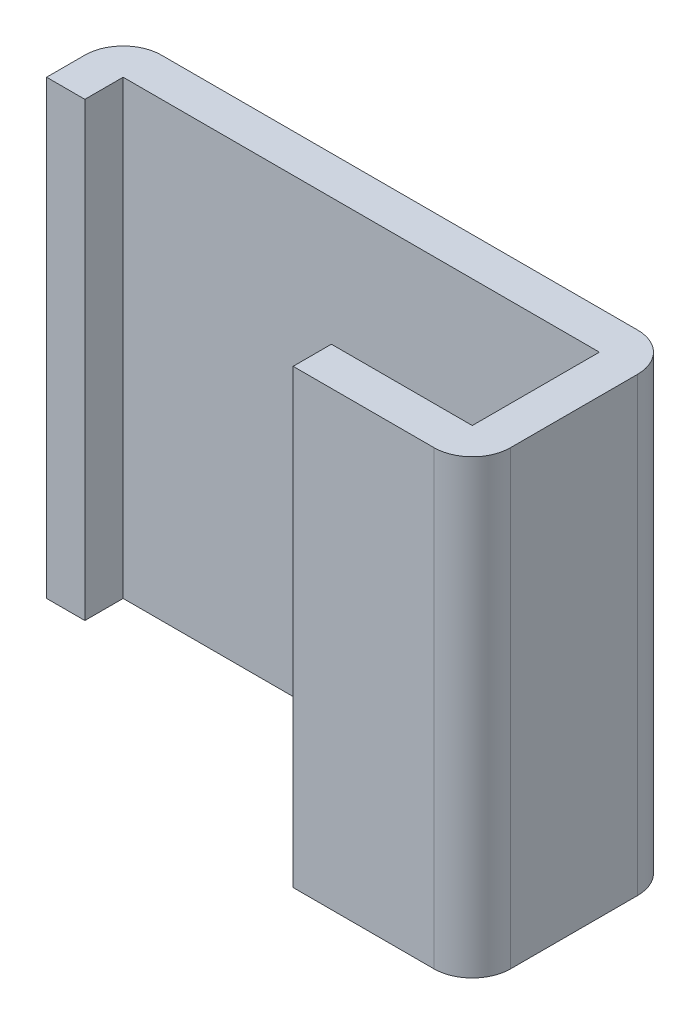
ISO-10303-21;
HEADER;
FILE_DESCRIPTION(('STEP AP214'),'2;1');
FILE_NAME('part.step','',(''),(''),'','','');
FILE_SCHEMA(('AUTOMOTIVE_DESIGN { 1 0 10303 214 1 1 1 1 }'));
ENDSEC;
DATA;
#1=APPLICATION_CONTEXT('core data for automotive mechanical design processes');
#2=APPLICATION_PROTOCOL_DEFINITION('international standard','automotive_design',2000,#1);
#3=PRODUCT_CONTEXT('',#1,'mechanical');
#4=PRODUCT('Part','Part','',(#3));
#5=PRODUCT_RELATED_PRODUCT_CATEGORY('part','',(#4));
#6=PRODUCT_DEFINITION_FORMATION('','',#4);
#7=PRODUCT_DEFINITION_CONTEXT('part definition',#1,'design');
#8=PRODUCT_DEFINITION('design','',#6,#7);
#9=PRODUCT_DEFINITION_SHAPE('','',#8);
#10=(LENGTH_UNIT() NAMED_UNIT(*) SI_UNIT(.MILLI.,.METRE.));
#11=(NAMED_UNIT(*) PLANE_ANGLE_UNIT() SI_UNIT($,.RADIAN.));
#12=(NAMED_UNIT(*) SI_UNIT($,.STERADIAN.) SOLID_ANGLE_UNIT());
#13=UNCERTAINTY_MEASURE_WITH_UNIT(LENGTH_MEASURE(1.E-05),#10,'distance_accuracy_value','');
#14=(GEOMETRIC_REPRESENTATION_CONTEXT(3) GLOBAL_UNCERTAINTY_ASSIGNED_CONTEXT((#13)) GLOBAL_UNIT_ASSIGNED_CONTEXT((#10,
#11,#12)) REPRESENTATION_CONTEXT('',''));
#15=CARTESIAN_POINT('',(0.,0.,0.));
#16=DIRECTION('',(0.,0.,1.));
#17=DIRECTION('',(1.,0.,0.));
#18=AXIS2_PLACEMENT_3D('',#15,#16,#17);
#19=CARTESIAN_POINT('',(-15.24,-1.474,1.08));
#20=DIRECTION('',(1.,0.,0.));
#21=DIRECTION('',(0.,0.,-1.));
#22=AXIS2_PLACEMENT_3D('',#19,#20,#21);
#23=PLANE('',#22);
#24=DIRECTION('',(0.,1.,0.));
#25=VECTOR('',#24,1.);
#26=CARTESIAN_POINT('',(-15.24,-1.474,1.33));
#27=LINE('',#26,#25);
#28=CARTESIAN_POINT('',(-15.24,1.474,1.33));
#29=VERTEX_POINT('',#28);
#30=CARTESIAN_POINT('',(-15.24,-1.474,1.33));
#31=VERTEX_POINT('',#30);
#32=EDGE_CURVE('E98',#29,#31,#27,.F.);
#33=ORIENTED_EDGE('',*,*,#32,.F.);
#34=DIRECTION('',(0.,0.,-1.));
#35=VECTOR('',#34,1.);
#36=CARTESIAN_POINT('',(-15.24,1.474,1.08));
#37=LINE('',#36,#35);
#38=CARTESIAN_POINT('',(-15.24,1.474,1.08));
#39=VERTEX_POINT('',#38);
#40=EDGE_CURVE('E103',#39,#29,#37,.F.);
#41=ORIENTED_EDGE('',*,*,#40,.F.);
#42=DIRECTION('',(0.,1.,0.));
#43=VECTOR('',#42,1.);
#44=CARTESIAN_POINT('',(-15.24,-1.474,1.08));
#45=LINE('',#44,#43);
#46=CARTESIAN_POINT('',(-15.24,-1.474,1.08));
#47=VERTEX_POINT('',#46);
#48=EDGE_CURVE('E127',#39,#47,#45,.F.);
#49=ORIENTED_EDGE('',*,*,#48,.T.);
#50=DIRECTION('',(0.,0.,-1.));
#51=VECTOR('',#50,1.);
#52=CARTESIAN_POINT('',(-15.24,-1.474,1.08));
#53=LINE('',#52,#51);
#54=EDGE_CURVE('E84',#31,#47,#53,.T.);
#55=ORIENTED_EDGE('',*,*,#54,.F.);
#56=EDGE_LOOP('',(#33,#41,#49,#55));
#57=FACE_BOUND('',#56,.T.);
#58=ADVANCED_FACE('F17',(#57),#23,.F.);
#59=CARTESIAN_POINT('',(-14.32,-1.474,1.33));
#60=DIRECTION('',(0.,0.,1.));
#61=DIRECTION('',(1.,0.,0.));
#62=AXIS2_PLACEMENT_3D('',#59,#60,#61);
#63=PLANE('',#62);
#64=ORIENTED_EDGE('',*,*,#32,.T.);
#65=DIRECTION('',(1.,0.,0.));
#66=VECTOR('',#65,1.);
#67=CARTESIAN_POINT('',(-14.32,-1.474,1.33));
#68=LINE('',#67,#66);
#69=CARTESIAN_POINT('',(-14.32,-1.474,1.33));
#70=VERTEX_POINT('',#69);
#71=EDGE_CURVE('E78',#31,#70,#68,.T.);
#72=ORIENTED_EDGE('',*,*,#71,.T.);
#73=DIRECTION('',(0.,-1.,0.));
#74=VECTOR('',#73,1.);
#75=CARTESIAN_POINT('',(-14.32,-1.474,1.33));
#76=LINE('',#75,#74);
#77=CARTESIAN_POINT('',(-14.32,1.474,1.33));
#78=VERTEX_POINT('',#77);
#79=EDGE_CURVE('E99',#78,#70,#76,.T.);
#80=ORIENTED_EDGE('',*,*,#79,.F.);
#81=DIRECTION('',(1.,0.,0.));
#82=VECTOR('',#81,1.);
#83=CARTESIAN_POINT('',(-14.32,1.474,1.33));
#84=LINE('',#83,#82);
#85=EDGE_CURVE('E94',#78,#29,#84,.F.);
#86=ORIENTED_EDGE('',*,*,#85,.T.);
#87=EDGE_LOOP('',(#64,#72,#80,#86));
#88=FACE_BOUND('',#87,.T.);
#89=ADVANCED_FACE('F96',(#88),#63,.T.);
#90=CARTESIAN_POINT('',(-14.32,-1.474,1.08));
#91=DIRECTION('',(0.,0.,1.));
#92=DIRECTION('',(1.,0.,0.));
#93=AXIS2_PLACEMENT_3D('',#90,#91,#92);
#94=PLANE('',#93);
#95=ORIENTED_EDGE('',*,*,#48,.F.);
#96=DIRECTION('',(1.,0.,0.));
#97=VECTOR('',#96,1.);
#98=CARTESIAN_POINT('',(-14.32,1.474,1.08));
#99=LINE('',#98,#97);
#100=CARTESIAN_POINT('',(-14.32,1.474,1.08));
#101=VERTEX_POINT('',#100);
#102=EDGE_CURVE('E108',#101,#39,#99,.F.);
#103=ORIENTED_EDGE('',*,*,#102,.F.);
#104=DIRECTION('',(0.,1.,0.));
#105=VECTOR('',#104,1.);
#106=CARTESIAN_POINT('',(-14.32,-1.474,1.08));
#107=LINE('',#106,#105);
#108=CARTESIAN_POINT('',(-14.32,-1.474,1.08));
#109=VERTEX_POINT('',#108);
#110=EDGE_CURVE('E181',#101,#109,#107,.F.);
#111=ORIENTED_EDGE('',*,*,#110,.T.);
#112=DIRECTION('',(1.,0.,0.));
#113=VECTOR('',#112,1.);
#114=CARTESIAN_POINT('',(-14.32,-1.474,1.08));
#115=LINE('',#114,#113);
#116=EDGE_CURVE('E125',#47,#109,#115,.T.);
#117=ORIENTED_EDGE('',*,*,#116,.F.);
#118=EDGE_LOOP('',(#95,#103,#111,#117));
#119=FACE_BOUND('',#118,.T.);
#120=ADVANCED_FACE('F379',(#119),#94,.F.);
#121=CARTESIAN_POINT('',(-14.32,-1.474,1.08));
#122=DIRECTION('',(0.,-1.,0.));
#123=DIRECTION('',(0.,0.,-1.));
#124=AXIS2_PLACEMENT_3D('',#121,#122,#123);
#125=CYLINDRICAL_SURFACE('',#124,0.25);
#126=CARTESIAN_POINT('',(-14.32,1.474,1.08));
#127=DIRECTION('',(0.,-1.,0.));
#128=DIRECTION('',(0.,0.,-1.));
#129=AXIS2_PLACEMENT_3D('',#126,#127,#128);
#130=CIRCLE('',#129,0.25);
#131=CARTESIAN_POINT('',(-14.07,1.474,1.08));
#132=VERTEX_POINT('',#131);
#133=EDGE_CURVE('E147',#132,#78,#130,.T.);
#134=ORIENTED_EDGE('',*,*,#133,.T.);
#135=ORIENTED_EDGE('',*,*,#79,.T.);
#136=CARTESIAN_POINT('',(-14.32,-1.474,1.08));
#137=DIRECTION('',(0.,-1.,0.));
#138=DIRECTION('',(0.,0.,-1.));
#139=AXIS2_PLACEMENT_3D('',#136,#137,#138);
#140=CIRCLE('',#139,0.25);
#141=CARTESIAN_POINT('',(-14.07,-1.474,1.08));
#142=VERTEX_POINT('',#141);
#143=EDGE_CURVE('E20',#70,#142,#140,.F.);
#144=ORIENTED_EDGE('',*,*,#143,.T.);
#145=DIRECTION('',(0.,1.,0.));
#146=VECTOR('',#145,1.);
#147=CARTESIAN_POINT('',(-14.07,-1.474,1.08));
#148=LINE('',#147,#146);
#149=EDGE_CURVE('E156',#142,#132,#148,.T.);
#150=ORIENTED_EDGE('',*,*,#149,.T.);
#151=EDGE_LOOP('',(#134,#135,#144,#150));
#152=FACE_BOUND('',#151,.T.);
#153=ADVANCED_FACE('F155',(#152),#125,.T.);
#154=CARTESIAN_POINT('',(-17.68,-1.474,0.5));
#155=DIRECTION('',(0.,0.,-1.));
#156=DIRECTION('',(-1.,0.,0.));
#157=AXIS2_PLACEMENT_3D('',#154,#155,#156);
#158=PLANE('',#157);
#159=DIRECTION('',(0.,1.,0.));
#160=VECTOR('',#159,1.);
#161=CARTESIAN_POINT('',(-17.43,-1.474,0.5));
#162=LINE('',#161,#160);
#163=CARTESIAN_POINT('',(-17.43,-1.474,0.5));
#164=VERTEX_POINT('',#163);
#165=CARTESIAN_POINT('',(-17.43,1.474,0.5));
#166=VERTEX_POINT('',#165);
#167=EDGE_CURVE('E194',#164,#166,#162,.T.);
#168=ORIENTED_EDGE('',*,*,#167,.T.);
#169=DIRECTION('',(-1.,0.,0.));
#170=VECTOR('',#169,1.);
#171=CARTESIAN_POINT('',(-17.68,1.474,0.5));
#172=LINE('',#171,#170);
#173=CARTESIAN_POINT('',(-17.68,1.474,0.5));
#174=VERTEX_POINT('',#173);
#175=EDGE_CURVE('E150',#174,#166,#172,.F.);
#176=ORIENTED_EDGE('',*,*,#175,.F.);
#177=DIRECTION('',(0.,1.,0.));
#178=VECTOR('',#177,1.);
#179=CARTESIAN_POINT('',(-17.68,-1.474,0.5));
#180=LINE('',#179,#178);
#181=CARTESIAN_POINT('',(-17.68,-1.474,0.5));
#182=VERTEX_POINT('',#181);
#183=EDGE_CURVE('E171',#174,#182,#180,.F.);
#184=ORIENTED_EDGE('',*,*,#183,.T.);
#185=DIRECTION('',(-1.,0.,0.));
#186=VECTOR('',#185,1.);
#187=CARTESIAN_POINT('',(-17.68,-1.474,0.5));
#188=LINE('',#187,#186);
#189=EDGE_CURVE('E189',#164,#182,#188,.T.);
#190=ORIENTED_EDGE('',*,*,#189,.F.);
#191=EDGE_LOOP('',(#168,#176,#184,#190));
#192=FACE_BOUND('',#191,.T.);
#193=ADVANCED_FACE('F278',(#192),#158,.F.);
#194=CARTESIAN_POINT('',(-17.43,-1.474,0.5));
#195=DIRECTION('',(-1.,0.,0.));
#196=DIRECTION('',(0.,0.,1.));
#197=AXIS2_PLACEMENT_3D('',#194,#195,#196);
#198=PLANE('',#197);
#199=DIRECTION('',(0.,1.,0.));
#200=VECTOR('',#199,1.);
#201=CARTESIAN_POINT('',(-17.43,-1.474,0.25));
#202=LINE('',#201,#200);
#203=CARTESIAN_POINT('',(-17.43,-1.474,0.25));
#204=VERTEX_POINT('',#203);
#205=CARTESIAN_POINT('',(-17.43,1.474,0.25));
#206=VERTEX_POINT('',#205);
#207=EDGE_CURVE('E222',#204,#206,#202,.T.);
#208=ORIENTED_EDGE('',*,*,#207,.T.);
#209=DIRECTION('',(0.,0.,1.));
#210=VECTOR('',#209,1.);
#211=CARTESIAN_POINT('',(-17.43,1.474,0.5));
#212=LINE('',#211,#210);
#213=EDGE_CURVE('E199',#166,#206,#212,.F.);
#214=ORIENTED_EDGE('',*,*,#213,.F.);
#215=ORIENTED_EDGE('',*,*,#167,.F.);
#216=DIRECTION('',(0.,0.,1.));
#217=VECTOR('',#216,1.);
#218=CARTESIAN_POINT('',(-17.43,-1.474,0.5));
#219=LINE('',#218,#217);
#220=EDGE_CURVE('E186',#204,#164,#219,.T.);
#221=ORIENTED_EDGE('',*,*,#220,.F.);
#222=EDGE_LOOP('',(#208,#214,#215,#221));
#223=FACE_BOUND('',#222,.T.);
#224=ADVANCED_FACE('F223',(#223),#198,.F.);
#225=CARTESIAN_POINT('',(-14.32,-1.474,0.25));
#226=DIRECTION('',(1.,0.,0.));
#227=DIRECTION('',(0.,0.,-1.));
#228=AXIS2_PLACEMENT_3D('',#225,#226,#227);
#229=PLANE('',#228);
#230=ORIENTED_EDGE('',*,*,#110,.F.);
#231=DIRECTION('',(0.,0.,-1.));
#232=VECTOR('',#231,1.);
#233=CARTESIAN_POINT('',(-14.32,1.474,0.25));
#234=LINE('',#233,#232);
#235=CARTESIAN_POINT('',(-14.32,1.474,0.25));
#236=VERTEX_POINT('',#235);
#237=EDGE_CURVE('E184',#236,#101,#234,.F.);
#238=ORIENTED_EDGE('',*,*,#237,.F.);
#239=DIRECTION('',(0.,1.,0.));
#240=VECTOR('',#239,1.);
#241=CARTESIAN_POINT('',(-14.32,-1.474,0.25));
#242=LINE('',#241,#240);
#243=CARTESIAN_POINT('',(-14.32,-1.474,0.25));
#244=VERTEX_POINT('',#243);
#245=EDGE_CURVE('E227',#236,#244,#242,.F.);
#246=ORIENTED_EDGE('',*,*,#245,.T.);
#247=DIRECTION('',(0.,0.,-1.));
#248=VECTOR('',#247,1.);
#249=CARTESIAN_POINT('',(-14.32,-1.474,0.25));
#250=LINE('',#249,#248);
#251=EDGE_CURVE('E166',#109,#244,#250,.T.);
#252=ORIENTED_EDGE('',*,*,#251,.F.);
#253=EDGE_LOOP('',(#230,#238,#246,#252));
#254=FACE_BOUND('',#253,.T.);
#255=ADVANCED_FACE('F349',(#254),#229,.F.);
#256=CARTESIAN_POINT('',(-14.07,-1.474,1.08));
#257=DIRECTION('',(-1.,0.,0.));
#258=DIRECTION('',(0.,0.,1.));
#259=AXIS2_PLACEMENT_3D('',#256,#257,#258);
#260=PLANE('',#259);
#261=DIRECTION('',(0.,-1.,0.));
#262=VECTOR('',#261,1.);
#263=CARTESIAN_POINT('',(-14.07,-1.474,0.25));
#264=LINE('',#263,#262);
#265=CARTESIAN_POINT('',(-14.07,1.474,0.25));
#266=VERTEX_POINT('',#265);
#267=CARTESIAN_POINT('',(-14.07,-1.474,0.25));
#268=VERTEX_POINT('',#267);
#269=EDGE_CURVE('E146',#266,#268,#264,.T.);
#270=ORIENTED_EDGE('',*,*,#269,.F.);
#271=DIRECTION('',(0.,0.,1.));
#272=VECTOR('',#271,1.);
#273=CARTESIAN_POINT('',(-14.07,1.474,1.08));
#274=LINE('',#273,#272);
#275=EDGE_CURVE('E165',#132,#266,#274,.F.);
#276=ORIENTED_EDGE('',*,*,#275,.F.);
#277=ORIENTED_EDGE('',*,*,#149,.F.);
#278=DIRECTION('',(0.,0.,1.));
#279=VECTOR('',#278,1.);
#280=CARTESIAN_POINT('',(-14.07,-1.474,1.08));
#281=LINE('',#280,#279);
#282=EDGE_CURVE('E163',#268,#142,#281,.T.);
#283=ORIENTED_EDGE('',*,*,#282,.F.);
#284=EDGE_LOOP('',(#270,#276,#277,#283));
#285=FACE_BOUND('',#284,.T.);
#286=ADVANCED_FACE('F162',(#285),#260,.F.);
#287=CARTESIAN_POINT('',(-17.68,-1.474,0.25));
#288=DIRECTION('',(1.,0.,0.));
#289=DIRECTION('',(0.,0.,-1.));
#290=AXIS2_PLACEMENT_3D('',#287,#288,#289);
#291=PLANE('',#290);
#292=ORIENTED_EDGE('',*,*,#183,.F.);
#293=DIRECTION('',(0.,0.,1.));
#294=VECTOR('',#293,1.);
#295=CARTESIAN_POINT('',(-17.68,1.474,0.25));
#296=LINE('',#295,#294);
#297=CARTESIAN_POINT('',(-17.68,1.474,0.25));
#298=VERTEX_POINT('',#297);
#299=EDGE_CURVE('E145',#298,#174,#296,.T.);
#300=ORIENTED_EDGE('',*,*,#299,.F.);
#301=DIRECTION('',(0.,-1.,0.));
#302=VECTOR('',#301,1.);
#303=CARTESIAN_POINT('',(-17.68,-1.474,0.25));
#304=LINE('',#303,#302);
#305=CARTESIAN_POINT('',(-17.68,-1.474,0.25));
#306=VERTEX_POINT('',#305);
#307=EDGE_CURVE('E143',#306,#298,#304,.F.);
#308=ORIENTED_EDGE('',*,*,#307,.F.);
#309=DIRECTION('',(0.,0.,-1.));
#310=VECTOR('',#309,1.);
#311=CARTESIAN_POINT('',(-17.68,-1.474,0.25));
#312=LINE('',#311,#310);
#313=EDGE_CURVE('E174',#182,#306,#312,.T.);
#314=ORIENTED_EDGE('',*,*,#313,.F.);
#315=EDGE_LOOP('',(#292,#300,#308,#314));
#316=FACE_BOUND('',#315,.T.);
#317=ADVANCED_FACE('F252',(#316),#291,.F.);
#318=CARTESIAN_POINT('',(-17.43,-1.474,0.25));
#319=DIRECTION('',(0.,0.,-1.));
#320=DIRECTION('',(-1.,0.,0.));
#321=AXIS2_PLACEMENT_3D('',#318,#319,#320);
#322=PLANE('',#321);
#323=ORIENTED_EDGE('',*,*,#245,.F.);
#324=DIRECTION('',(1.,0.,0.));
#325=VECTOR('',#324,1.);
#326=CARTESIAN_POINT('',(-14.32,1.474,0.25));
#327=LINE('',#326,#325);
#328=EDGE_CURVE('E213',#206,#236,#327,.T.);
#329=ORIENTED_EDGE('',*,*,#328,.F.);
#330=ORIENTED_EDGE('',*,*,#207,.F.);
#331=DIRECTION('',(1.,0.,0.));
#332=VECTOR('',#331,1.);
#333=CARTESIAN_POINT('',(-14.32,-1.474,0.25));
#334=LINE('',#333,#332);
#335=EDGE_CURVE('E137',#204,#244,#334,.T.);
#336=ORIENTED_EDGE('',*,*,#335,.T.);
#337=EDGE_LOOP('',(#323,#329,#330,#336));
#338=FACE_BOUND('',#337,.T.);
#339=ADVANCED_FACE('F230',(#338),#322,.F.);
#340=CARTESIAN_POINT('',(-14.32,-1.474,0.25));
#341=DIRECTION('',(0.,-1.,0.));
#342=DIRECTION('',(0.,0.,-1.));
#343=AXIS2_PLACEMENT_3D('',#340,#341,#342);
#344=CYLINDRICAL_SURFACE('',#343,0.25);
#345=CARTESIAN_POINT('',(-14.32,1.474,0.25));
#346=DIRECTION('',(0.,-1.,0.));
#347=DIRECTION('',(0.,0.,-1.));
#348=AXIS2_PLACEMENT_3D('',#345,#346,#347);
#349=CIRCLE('',#348,0.25);
#350=CARTESIAN_POINT('',(-14.32,1.474,0.));
#351=VERTEX_POINT('',#350);
#352=EDGE_CURVE('E144',#266,#351,#349,.F.);
#353=ORIENTED_EDGE('',*,*,#352,.F.);
#354=ORIENTED_EDGE('',*,*,#269,.T.);
#355=CARTESIAN_POINT('',(-14.32,-1.474,0.25));
#356=DIRECTION('',(0.,-1.,0.));
#357=DIRECTION('',(0.,0.,-1.));
#358=AXIS2_PLACEMENT_3D('',#355,#356,#357);
#359=CIRCLE('',#358,0.25);
#360=CARTESIAN_POINT('',(-14.32,-1.474,0.));
#361=VERTEX_POINT('',#360);
#362=EDGE_CURVE('E138',#268,#361,#359,.F.);
#363=ORIENTED_EDGE('',*,*,#362,.T.);
#364=DIRECTION('',(0.,1.,0.));
#365=VECTOR('',#364,1.);
#366=CARTESIAN_POINT('',(-14.32,-1.474,0.));
#367=LINE('',#366,#365);
#368=EDGE_CURVE('E262',#361,#351,#367,.T.);
#369=ORIENTED_EDGE('',*,*,#368,.T.);
#370=EDGE_LOOP('',(#353,#354,#363,#369));
#371=FACE_BOUND('',#370,.T.);
#372=ADVANCED_FACE('F280',(#371),#344,.T.);
#373=CARTESIAN_POINT('',(-14.32,1.474,0.25));
#374=DIRECTION('',(0.,1.,0.));
#375=DIRECTION('',(0.,0.,1.));
#376=AXIS2_PLACEMENT_3D('',#373,#374,#375);
#377=PLANE('',#376);
#378=ORIENTED_EDGE('',*,*,#213,.T.);
#379=ORIENTED_EDGE('',*,*,#328,.T.);
#380=ORIENTED_EDGE('',*,*,#237,.T.);
#381=ORIENTED_EDGE('',*,*,#102,.T.);
#382=ORIENTED_EDGE('',*,*,#40,.T.);
#383=ORIENTED_EDGE('',*,*,#85,.F.);
#384=ORIENTED_EDGE('',*,*,#133,.F.);
#385=ORIENTED_EDGE('',*,*,#275,.T.);
#386=ORIENTED_EDGE('',*,*,#352,.T.);
#387=DIRECTION('',(1.,0.,0.));
#388=VECTOR('',#387,1.);
#389=CARTESIAN_POINT('',(-14.32,1.474,0.));
#390=LINE('',#389,#388);
#391=CARTESIAN_POINT('',(-17.43,1.474,0.));
#392=VERTEX_POINT('',#391);
#393=EDGE_CURVE('E236',#351,#392,#390,.F.);
#394=ORIENTED_EDGE('',*,*,#393,.T.);
#395=CARTESIAN_POINT('',(-17.43,1.474,0.25));
#396=DIRECTION('',(0.,-1.,0.));
#397=DIRECTION('',(0.,0.,-1.));
#398=AXIS2_PLACEMENT_3D('',#395,#396,#397);
#399=CIRCLE('',#398,0.25);
#400=EDGE_CURVE('E141',#298,#392,#399,.T.);
#401=ORIENTED_EDGE('',*,*,#400,.F.);
#402=ORIENTED_EDGE('',*,*,#299,.T.);
#403=ORIENTED_EDGE('',*,*,#175,.T.);
#404=EDGE_LOOP('',(#378,#379,#380,#381,#382,#383,#384,#385,#386,#394,#401,#402,#403));
#405=FACE_BOUND('',#404,.T.);
#406=ADVANCED_FACE('F105',(#405),#377,.T.);
#407=CARTESIAN_POINT('',(-17.43,-1.474,0.25));
#408=DIRECTION('',(0.,-1.,0.));
#409=DIRECTION('',(0.,0.,-1.));
#410=AXIS2_PLACEMENT_3D('',#407,#408,#409);
#411=CYLINDRICAL_SURFACE('',#410,0.25);
#412=ORIENTED_EDGE('',*,*,#400,.T.);
#413=DIRECTION('',(0.,1.,0.));
#414=VECTOR('',#413,1.);
#415=CARTESIAN_POINT('',(-17.43,-1.474,0.));
#416=LINE('',#415,#414);
#417=CARTESIAN_POINT('',(-17.43,-1.474,0.));
#418=VERTEX_POINT('',#417);
#419=EDGE_CURVE('E26',#392,#418,#416,.F.);
#420=ORIENTED_EDGE('',*,*,#419,.T.);
#421=CARTESIAN_POINT('',(-17.43,-1.474,0.25));
#422=DIRECTION('',(0.,-1.,0.));
#423=DIRECTION('',(0.,0.,-1.));
#424=AXIS2_PLACEMENT_3D('',#421,#422,#423);
#425=CIRCLE('',#424,0.25);
#426=EDGE_CURVE('E34',#418,#306,#425,.F.);
#427=ORIENTED_EDGE('',*,*,#426,.T.);
#428=ORIENTED_EDGE('',*,*,#307,.T.);
#429=EDGE_LOOP('',(#412,#420,#427,#428));
#430=FACE_BOUND('',#429,.T.);
#431=ADVANCED_FACE('F256',(#430),#411,.T.);
#432=CARTESIAN_POINT('',(-14.32,-1.474,0.25));
#433=DIRECTION('',(0.,1.,0.));
#434=DIRECTION('',(0.,0.,1.));
#435=AXIS2_PLACEMENT_3D('',#432,#433,#434);
#436=PLANE('',#435);
#437=ORIENTED_EDGE('',*,*,#220,.T.);
#438=ORIENTED_EDGE('',*,*,#189,.T.);
#439=ORIENTED_EDGE('',*,*,#313,.T.);
#440=ORIENTED_EDGE('',*,*,#426,.F.);
#441=DIRECTION('',(1.,0.,0.));
#442=VECTOR('',#441,1.);
#443=CARTESIAN_POINT('',(-14.32,-1.474,0.));
#444=LINE('',#443,#442);
#445=EDGE_CURVE('E11',#418,#361,#444,.T.);
#446=ORIENTED_EDGE('',*,*,#445,.T.);
#447=ORIENTED_EDGE('',*,*,#362,.F.);
#448=ORIENTED_EDGE('',*,*,#282,.T.);
#449=ORIENTED_EDGE('',*,*,#143,.F.);
#450=ORIENTED_EDGE('',*,*,#71,.F.);
#451=ORIENTED_EDGE('',*,*,#54,.T.);
#452=ORIENTED_EDGE('',*,*,#116,.T.);
#453=ORIENTED_EDGE('',*,*,#251,.T.);
#454=ORIENTED_EDGE('',*,*,#335,.F.);
#455=EDGE_LOOP('',(#437,#438,#439,#440,#446,#447,#448,#449,#450,#451,#452,#453,#454));
#456=FACE_BOUND('',#455,.T.);
#457=ADVANCED_FACE('F170',(#456),#436,.F.);
#458=CARTESIAN_POINT('',(-14.32,-1.474,0.));
#459=DIRECTION('',(0.,0.,1.));
#460=DIRECTION('',(1.,0.,0.));
#461=AXIS2_PLACEMENT_3D('',#458,#459,#460);
#462=PLANE('',#461);
#463=ORIENTED_EDGE('',*,*,#419,.F.);
#464=ORIENTED_EDGE('',*,*,#393,.F.);
#465=ORIENTED_EDGE('',*,*,#368,.F.);
#466=ORIENTED_EDGE('',*,*,#445,.F.);
#467=EDGE_LOOP('',(#463,#464,#465,#466));
#468=FACE_BOUND('',#467,.T.);
#469=ADVANCED_FACE('F279',(#468),#462,.F.);
#470=CLOSED_SHELL('',(#58,#89,#120,#153,#193,#224,#255,#286,#317,#339,#372,#406,#431,#457,#469));
#471=MANIFOLD_SOLID_BREP('B1',#470);
#472=ADVANCED_BREP_SHAPE_REPRESENTATION('',(#18,#471),#14);
#473=SHAPE_DEFINITION_REPRESENTATION(#9,#472);
ENDSEC;
END-ISO-10303-21;
